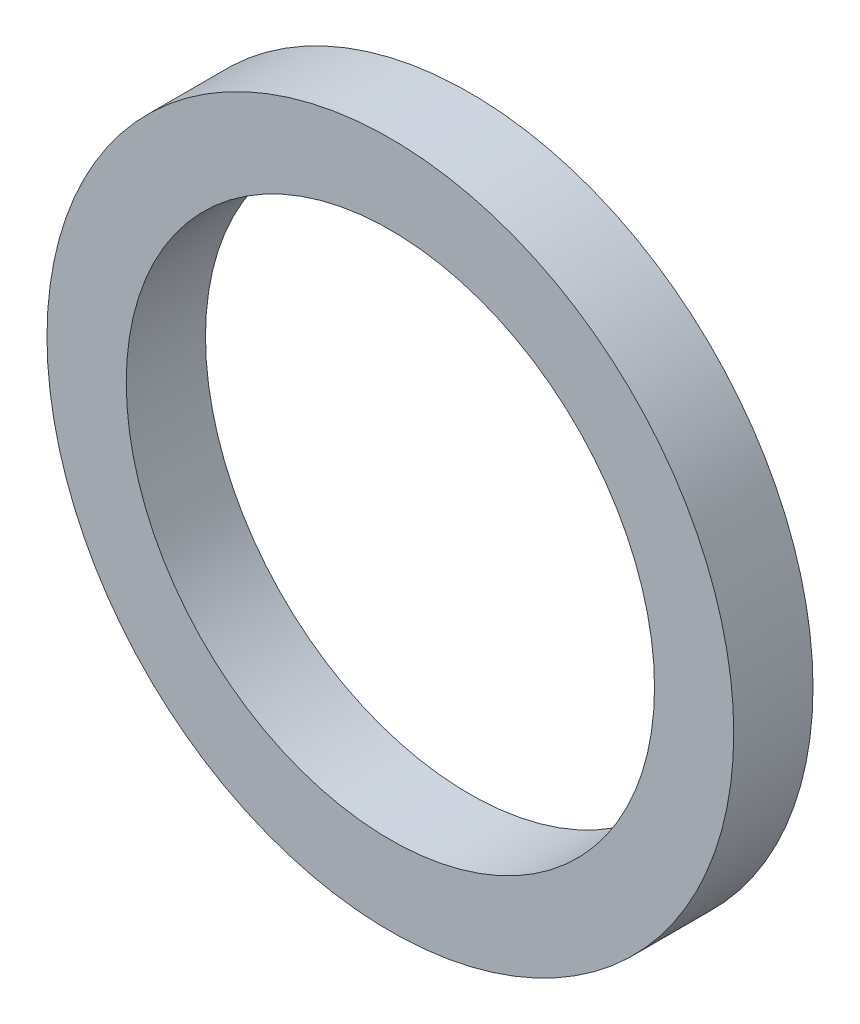
ISO-10303-21;
HEADER;
FILE_DESCRIPTION(('STEP AP214'),'2;1');
FILE_NAME('part.step','',(''),(''),'','','');
FILE_SCHEMA(('AUTOMOTIVE_DESIGN { 1 0 10303 214 1 1 1 1 }'));
ENDSEC;
DATA;
#1=APPLICATION_CONTEXT('core data for automotive mechanical design processes');
#2=APPLICATION_PROTOCOL_DEFINITION('international standard','automotive_design',2000,#1);
#3=PRODUCT_CONTEXT('',#1,'mechanical');
#4=PRODUCT('Part','Part','',(#3));
#5=PRODUCT_RELATED_PRODUCT_CATEGORY('part','',(#4));
#6=PRODUCT_DEFINITION_FORMATION('','',#4);
#7=PRODUCT_DEFINITION_CONTEXT('part definition',#1,'design');
#8=PRODUCT_DEFINITION('design','',#6,#7);
#9=PRODUCT_DEFINITION_SHAPE('','',#8);
#10=(LENGTH_UNIT() NAMED_UNIT(*) SI_UNIT(.MILLI.,.METRE.));
#11=(NAMED_UNIT(*) PLANE_ANGLE_UNIT() SI_UNIT($,.RADIAN.));
#12=(NAMED_UNIT(*) SI_UNIT($,.STERADIAN.) SOLID_ANGLE_UNIT());
#13=UNCERTAINTY_MEASURE_WITH_UNIT(LENGTH_MEASURE(1.E-05),#10,'distance_accuracy_value','');
#14=(GEOMETRIC_REPRESENTATION_CONTEXT(3) GLOBAL_UNCERTAINTY_ASSIGNED_CONTEXT((#13)) GLOBAL_UNIT_ASSIGNED_CONTEXT((#10,
#11,#12)) REPRESENTATION_CONTEXT('',''));
#15=CARTESIAN_POINT('',(0.,0.,0.));
#16=DIRECTION('',(0.,0.,1.));
#17=DIRECTION('',(1.,0.,0.));
#18=AXIS2_PLACEMENT_3D('',#15,#16,#17);
#19=CARTESIAN_POINT('',(0.,0.,3.));
#20=DIRECTION('',(0.,0.,1.));
#21=DIRECTION('',(1.,0.,0.));
#22=AXIS2_PLACEMENT_3D('',#19,#20,#21);
#23=PLANE('',#22);
#24=CARTESIAN_POINT('',(0.,0.,3.));
#25=DIRECTION('',(0.,0.,1.));
#26=DIRECTION('',(1.,0.,0.));
#27=AXIS2_PLACEMENT_3D('',#24,#25,#26);
#28=CIRCLE('',#27,13.);
#29=CARTESIAN_POINT('',(13.,0.,3.));
#30=VERTEX_POINT('',#29);
#31=EDGE_CURVE('E10',#30,#30,#28,.T.);
#32=ORIENTED_EDGE('',*,*,#31,.T.);
#33=EDGE_LOOP('',(#32));
#34=FACE_BOUND('',#33,.T.);
#35=CARTESIAN_POINT('',(0.,0.,3.));
#36=DIRECTION('',(0.,0.,1.));
#37=DIRECTION('',(1.,0.,0.));
#38=AXIS2_PLACEMENT_3D('',#35,#36,#37);
#39=CIRCLE('',#38,10.);
#40=CARTESIAN_POINT('',(10.,0.,3.));
#41=VERTEX_POINT('',#40);
#42=EDGE_CURVE('E56',#41,#41,#39,.T.);
#43=ORIENTED_EDGE('',*,*,#42,.F.);
#44=EDGE_LOOP('',(#43));
#45=FACE_BOUND('',#44,.T.);
#46=ADVANCED_FACE('F43',(#34,#45),#23,.T.);
#47=CARTESIAN_POINT('',(0.,0.,0.));
#48=DIRECTION('',(0.,0.,1.));
#49=DIRECTION('',(1.,0.,0.));
#50=AXIS2_PLACEMENT_3D('',#47,#48,#49);
#51=PLANE('',#50);
#52=CARTESIAN_POINT('',(0.,0.,0.));
#53=DIRECTION('',(0.,0.,1.));
#54=DIRECTION('',(1.,0.,0.));
#55=AXIS2_PLACEMENT_3D('',#52,#53,#54);
#56=CIRCLE('',#55,13.);
#57=CARTESIAN_POINT('',(13.,0.,0.));
#58=VERTEX_POINT('',#57);
#59=EDGE_CURVE('E47',#58,#58,#56,.T.);
#60=ORIENTED_EDGE('',*,*,#59,.F.);
#61=EDGE_LOOP('',(#60));
#62=FACE_BOUND('',#61,.T.);
#63=CARTESIAN_POINT('',(0.,0.,0.));
#64=DIRECTION('',(0.,0.,1.));
#65=DIRECTION('',(1.,0.,0.));
#66=AXIS2_PLACEMENT_3D('',#63,#64,#65);
#67=CIRCLE('',#66,10.);
#68=CARTESIAN_POINT('',(10.,0.,0.));
#69=VERTEX_POINT('',#68);
#70=EDGE_CURVE('E58',#69,#69,#67,.T.);
#71=ORIENTED_EDGE('',*,*,#70,.T.);
#72=EDGE_LOOP('',(#71));
#73=FACE_BOUND('',#72,.T.);
#74=ADVANCED_FACE('F70',(#62,#73),#51,.F.);
#75=CARTESIAN_POINT('',(0.,0.,3.));
#76=DIRECTION('',(0.,0.,-1.));
#77=DIRECTION('',(-1.,0.,0.));
#78=AXIS2_PLACEMENT_3D('',#75,#76,#77);
#79=CYLINDRICAL_SURFACE('',#78,13.);
#80=ORIENTED_EDGE('',*,*,#31,.F.);
#81=EDGE_LOOP('',(#80));
#82=FACE_BOUND('',#81,.T.);
#83=ORIENTED_EDGE('',*,*,#59,.T.);
#84=EDGE_LOOP('',(#83));
#85=FACE_BOUND('',#84,.T.);
#86=ADVANCED_FACE('F45',(#82,#85),#79,.T.);
#87=CARTESIAN_POINT('',(0.,0.,3.));
#88=DIRECTION('',(0.,0.,-1.));
#89=DIRECTION('',(-1.,0.,0.));
#90=AXIS2_PLACEMENT_3D('',#87,#88,#89);
#91=CYLINDRICAL_SURFACE('',#90,10.);
#92=ORIENTED_EDGE('',*,*,#42,.T.);
#93=EDGE_LOOP('',(#92));
#94=FACE_BOUND('',#93,.T.);
#95=ORIENTED_EDGE('',*,*,#70,.F.);
#96=EDGE_LOOP('',(#95));
#97=FACE_BOUND('',#96,.T.);
#98=ADVANCED_FACE('F66',(#94,#97),#91,.F.);
#99=CLOSED_SHELL('',(#46,#74,#86,#98));
#100=MANIFOLD_SOLID_BREP('B2',#99);
#101=ADVANCED_BREP_SHAPE_REPRESENTATION('',(#18,#100),#14);
#102=SHAPE_DEFINITION_REPRESENTATION(#9,#101);
ENDSEC;
END-ISO-10303-21;
